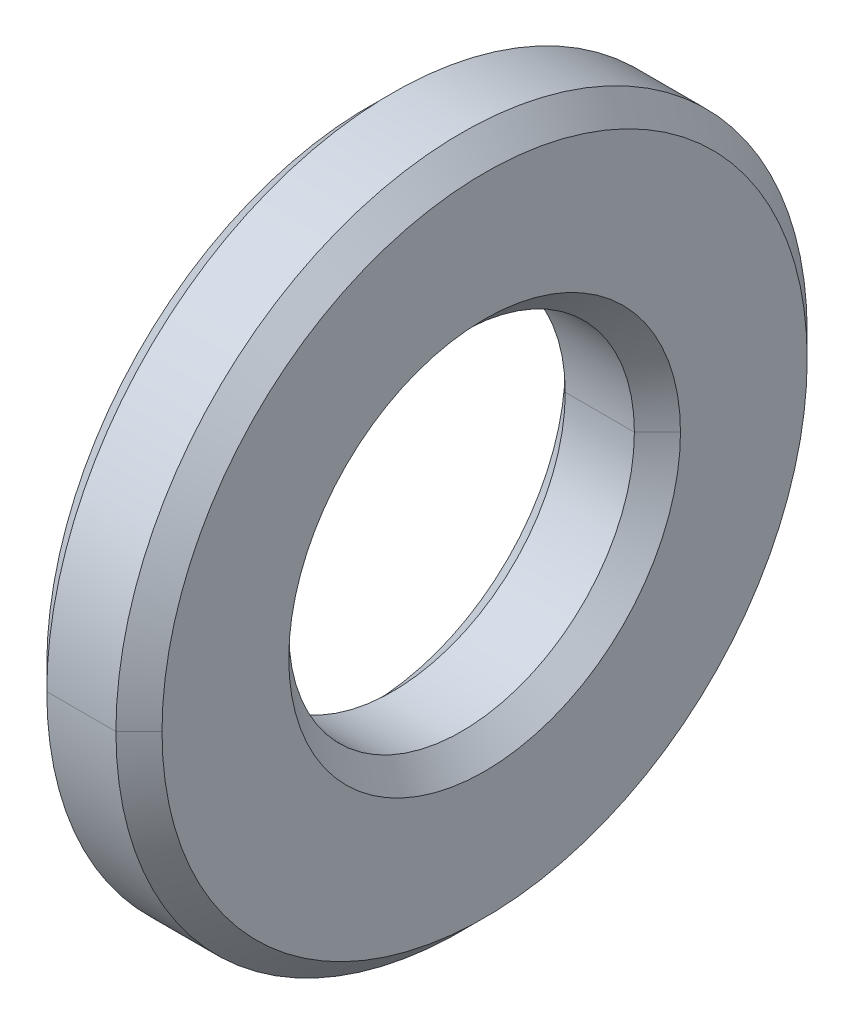
ISO-10303-21;
HEADER;
FILE_DESCRIPTION(('STEP AP214'),'2;1');
FILE_NAME('part.step','',(''),(''),'','','');
FILE_SCHEMA(('AUTOMOTIVE_DESIGN { 1 0 10303 214 1 1 1 1 }'));
ENDSEC;
DATA;
#1=APPLICATION_CONTEXT('core data for automotive mechanical design processes');
#2=APPLICATION_PROTOCOL_DEFINITION('international standard','automotive_design',2000,#1);
#3=PRODUCT_CONTEXT('',#1,'mechanical');
#4=PRODUCT('Part','Part','',(#3));
#5=PRODUCT_RELATED_PRODUCT_CATEGORY('part','',(#4));
#6=PRODUCT_DEFINITION_FORMATION('','',#4);
#7=PRODUCT_DEFINITION_CONTEXT('part definition',#1,'design');
#8=PRODUCT_DEFINITION('design','',#6,#7);
#9=PRODUCT_DEFINITION_SHAPE('','',#8);
#10=(LENGTH_UNIT() NAMED_UNIT(*) SI_UNIT(.MILLI.,.METRE.));
#11=(NAMED_UNIT(*) PLANE_ANGLE_UNIT() SI_UNIT($,.RADIAN.));
#12=(NAMED_UNIT(*) SI_UNIT($,.STERADIAN.) SOLID_ANGLE_UNIT());
#13=UNCERTAINTY_MEASURE_WITH_UNIT(LENGTH_MEASURE(1.E-05),#10,'distance_accuracy_value','');
#14=(GEOMETRIC_REPRESENTATION_CONTEXT(3) GLOBAL_UNCERTAINTY_ASSIGNED_CONTEXT((#13)) GLOBAL_UNIT_ASSIGNED_CONTEXT((#10,
#11,#12)) REPRESENTATION_CONTEXT('',''));
#15=CARTESIAN_POINT('',(0.,0.,0.));
#16=DIRECTION('',(0.,0.,1.));
#17=DIRECTION('',(1.,0.,0.));
#18=AXIS2_PLACEMENT_3D('',#15,#16,#17);
#19=CARTESIAN_POINT('',(1.,2.79999999999999,0.));
#20=DIRECTION('',(-1.,0.,0.));
#21=DIRECTION('',(0.,0.,1.00000000000002));
#22=AXIS2_PLACEMENT_3D('',#19,#20,#21);
#23=PLANE('',#22);
#24=CARTESIAN_POINT('',(1.,1.11022302462516E-13,-1.66533453693773E-13));
#25=DIRECTION('',(1.,0.,0.));
#26=DIRECTION('',(0.,0.,-1.00000000000002));
#27=AXIS2_PLACEMENT_3D('',#24,#25,#26);
#28=CIRCLE('',#27,1.7);
#29=CARTESIAN_POINT('',(0.999999999999994,0.,-1.70000000000009));
#30=VERTEX_POINT('',#29);
#31=CARTESIAN_POINT('',(0.999999999999508,0.,1.70000000000056));
#32=VERTEX_POINT('',#31);
#33=EDGE_CURVE('E11',#30,#32,#28,.T.);
#34=ORIENTED_EDGE('',*,*,#33,.F.);
#35=CARTESIAN_POINT('',(1.,1.11022302462516E-13,-1.66533453693773E-13));
#36=DIRECTION('',(1.,0.,0.));
#37=DIRECTION('',(0.,0.,-1.00000000000002));
#38=AXIS2_PLACEMENT_3D('',#35,#36,#37);
#39=CIRCLE('',#38,1.7);
#40=EDGE_CURVE('E25',#32,#30,#39,.T.);
#41=ORIENTED_EDGE('',*,*,#40,.F.);
#42=EDGE_LOOP('',(#34,#41));
#43=FACE_BOUND('',#42,.T.);
#44=CARTESIAN_POINT('',(1.,1.11022302462516E-13,-1.66533453693773E-13));
#45=DIRECTION('',(1.,0.,0.));
#46=DIRECTION('',(0.,0.,-1.00000000000002));
#47=AXIS2_PLACEMENT_3D('',#44,#45,#46);
#48=CIRCLE('',#47,2.8);
#49=CARTESIAN_POINT('',(0.999999999999945,0.,-2.80000000000019));
#50=VERTEX_POINT('',#49);
#51=CARTESIAN_POINT('',(0.99999999999955,0.,2.79999999999955));
#52=VERTEX_POINT('',#51);
#53=EDGE_CURVE('E393',#50,#52,#48,.T.);
#54=ORIENTED_EDGE('',*,*,#53,.T.);
#55=CARTESIAN_POINT('',(1.,1.11022302462516E-13,-1.66533453693773E-13));
#56=DIRECTION('',(1.,0.,0.));
#57=DIRECTION('',(0.,0.,-1.00000000000002));
#58=AXIS2_PLACEMENT_3D('',#55,#56,#57);
#59=CIRCLE('',#58,2.8);
#60=EDGE_CURVE('E388',#52,#50,#59,.T.);
#61=ORIENTED_EDGE('',*,*,#60,.T.);
#62=EDGE_LOOP('',(#54,#61));
#63=FACE_BOUND('',#62,.T.);
#64=ADVANCED_FACE('F16',(#43,#63),#23,.F.);
#65=CARTESIAN_POINT('',(0.799999999999995,1.11022302462516E-13,-1.66533453693773E-13));
#66=DIRECTION('',(-1.,0.,0.));
#67=DIRECTION('',(0.,1.00000000000002,0.));
#68=AXIS2_PLACEMENT_3D('',#65,#66,#67);
#69=CONICAL_SURFACE('',#68,3.,0.7853981634);
#70=CARTESIAN_POINT('',(0.799999999999995,1.11022302462516E-13,-1.66533453693773E-13));
#71=DIRECTION('',(1.,0.,0.));
#72=DIRECTION('',(0.,0.,-1.00000000000002));
#73=AXIS2_PLACEMENT_3D('',#70,#71,#72);
#74=CIRCLE('',#73,3.);
#75=CARTESIAN_POINT('',(0.800000000000051,0.,2.99999999999995));
#76=VERTEX_POINT('',#75);
#77=CARTESIAN_POINT('',(0.80000000000003,0.,-3.));
#78=VERTEX_POINT('',#77);
#79=EDGE_CURVE('E385',#76,#78,#74,.T.);
#80=ORIENTED_EDGE('',*,*,#79,.T.);
#81=CARTESIAN_POINT('',(0.999999999999485,1.11225791671262E-13,-2.7999999999997));
#82=DIRECTION('',(-0.707106781184737,0.,-0.707106781188358));
#83=VECTOR('',#82,1.);
#84=LINE('',#81,#83);
#85=EDGE_CURVE('E363',#50,#78,#84,.T.);
#86=ORIENTED_EDGE('',*,*,#85,.F.);
#87=ORIENTED_EDGE('',*,*,#60,.F.);
#88=CARTESIAN_POINT('',(0.999999999999485,1.10702239836183E-13,2.79999999999937));
#89=DIRECTION('',(-0.707106781184737,0.,0.707106781188358));
#90=VECTOR('',#89,1.);
#91=LINE('',#88,#90);
#92=EDGE_CURVE('E375',#52,#76,#91,.T.);
#93=ORIENTED_EDGE('',*,*,#92,.T.);
#94=EDGE_LOOP('',(#80,#86,#87,#93));
#95=FACE_BOUND('',#94,.T.);
#96=ADVANCED_FACE('F343',(#95),#69,.T.);
#97=CARTESIAN_POINT('',(0.799999999999995,1.11022302462516E-13,-1.66533453693773E-13));
#98=DIRECTION('',(-1.,0.,0.));
#99=DIRECTION('',(0.,-1.00000000000002,0.));
#100=AXIS2_PLACEMENT_3D('',#97,#98,#99);
#101=CONICAL_SURFACE('',#100,3.,0.7853981634);
#102=ORIENTED_EDGE('',*,*,#53,.F.);
#103=ORIENTED_EDGE('',*,*,#85,.T.);
#104=CARTESIAN_POINT('',(0.799999999999995,1.11022302462516E-13,-1.66533453693773E-13));
#105=DIRECTION('',(1.,0.,0.));
#106=DIRECTION('',(0.,0.,-1.00000000000002));
#107=AXIS2_PLACEMENT_3D('',#104,#105,#106);
#108=CIRCLE('',#107,3.);
#109=EDGE_CURVE('E415',#78,#76,#108,.T.);
#110=ORIENTED_EDGE('',*,*,#109,.T.);
#111=ORIENTED_EDGE('',*,*,#92,.F.);
#112=EDGE_LOOP('',(#102,#103,#110,#111));
#113=FACE_BOUND('',#112,.T.);
#114=ADVANCED_FACE('F335',(#113),#101,.T.);
#115=CARTESIAN_POINT('',(1.,1.11022302462516E-13,-1.66533453693773E-13));
#116=DIRECTION('',(-1.,0.,0.));
#117=DIRECTION('',(0.,-1.00000000000002,0.));
#118=AXIS2_PLACEMENT_3D('',#115,#116,#117);
#119=CYLINDRICAL_SURFACE('',#118,3.);
#120=ORIENTED_EDGE('',*,*,#109,.F.);
#121=CARTESIAN_POINT('',(0.800000000000001,1.11365226705015E-13,-3.00000000000021));
#122=DIRECTION('',(-1.,0.,0.));
#123=VECTOR('',#122,1.);
#124=LINE('',#121,#123);
#125=CARTESIAN_POINT('',(0.20000000000004,0.,-2.99999999999989));
#126=VERTEX_POINT('',#125);
#127=EDGE_CURVE('E298',#78,#126,#124,.T.);
#128=ORIENTED_EDGE('',*,*,#127,.T.);
#129=CARTESIAN_POINT('',(0.200000000000006,1.11022302462516E-13,0.));
#130=DIRECTION('',(1.,0.,0.));
#131=DIRECTION('',(0.,0.,-1.00000000000002));
#132=AXIS2_PLACEMENT_3D('',#129,#130,#131);
#133=CIRCLE('',#132,3.);
#134=CARTESIAN_POINT('',(0.19999999999995,0.,3.00000000000011));
#135=VERTEX_POINT('',#134);
#136=EDGE_CURVE('E316',#126,#135,#133,.T.);
#137=ORIENTED_EDGE('',*,*,#136,.T.);
#138=CARTESIAN_POINT('',(0.800000000000001,1.10804278310287E-13,2.99999999999988));
#139=DIRECTION('',(-1.,0.,0.));
#140=VECTOR('',#139,1.);
#141=LINE('',#138,#140);
#142=EDGE_CURVE('E301',#76,#135,#141,.T.);
#143=ORIENTED_EDGE('',*,*,#142,.F.);
#144=EDGE_LOOP('',(#120,#128,#137,#143));
#145=FACE_BOUND('',#144,.T.);
#146=ADVANCED_FACE('F281',(#145),#119,.T.);
#147=CARTESIAN_POINT('',(1.,1.11022302462516E-13,-1.66533453693773E-13));
#148=DIRECTION('',(-1.,0.,0.));
#149=DIRECTION('',(0.,1.00000000000002,0.));
#150=AXIS2_PLACEMENT_3D('',#147,#148,#149);
#151=CYLINDRICAL_SURFACE('',#150,3.);
#152=CARTESIAN_POINT('',(0.200000000000006,1.11022302462516E-13,0.));
#153=DIRECTION('',(1.,0.,0.));
#154=DIRECTION('',(0.,0.,-1.00000000000002));
#155=AXIS2_PLACEMENT_3D('',#152,#153,#154);
#156=CIRCLE('',#155,3.);
#157=EDGE_CURVE('E264',#135,#126,#156,.T.);
#158=ORIENTED_EDGE('',*,*,#157,.T.);
#159=ORIENTED_EDGE('',*,*,#127,.F.);
#160=ORIENTED_EDGE('',*,*,#79,.F.);
#161=ORIENTED_EDGE('',*,*,#142,.T.);
#162=EDGE_LOOP('',(#158,#159,#160,#161));
#163=FACE_BOUND('',#162,.T.);
#164=ADVANCED_FACE('F272',(#163),#151,.T.);
#165=CARTESIAN_POINT('',(0.,0.,0.));
#166=DIRECTION('',(1.,0.,0.));
#167=DIRECTION('',(0.,1.00000000000002,0.));
#168=AXIS2_PLACEMENT_3D('',#165,#166,#167);
#169=CONICAL_SURFACE('',#168,2.8,0.7853981634);
#170=CARTESIAN_POINT('',(0.,0.,0.));
#171=DIRECTION('',(1.,0.,0.));
#172=DIRECTION('',(0.,0.,-1.00000000000002));
#173=AXIS2_PLACEMENT_3D('',#170,#171,#172);
#174=CIRCLE('',#173,2.8);
#175=CARTESIAN_POINT('',(0.,0.,2.80000000000027));
#176=VERTEX_POINT('',#175);
#177=CARTESIAN_POINT('',(0.,0.,-2.80000000000002));
#178=VERTEX_POINT('',#177);
#179=EDGE_CURVE('E261',#176,#178,#174,.T.);
#180=ORIENTED_EDGE('',*,*,#179,.T.);
#181=CARTESIAN_POINT('',(0.,0.,-2.80000000000004));
#182=DIRECTION('',(0.707106781184737,0.,-0.707106781188358));
#183=VECTOR('',#182,1.);
#184=LINE('',#181,#183);
#185=EDGE_CURVE('E238',#178,#126,#184,.T.);
#186=ORIENTED_EDGE('',*,*,#185,.T.);
#187=ORIENTED_EDGE('',*,*,#157,.F.);
#188=CARTESIAN_POINT('',(0.,0.,2.80000000000004));
#189=DIRECTION('',(0.707106781184737,0.,0.707106781188358));
#190=VECTOR('',#189,1.);
#191=LINE('',#188,#190);
#192=EDGE_CURVE('E251',#176,#135,#191,.T.);
#193=ORIENTED_EDGE('',*,*,#192,.F.);
#194=EDGE_LOOP('',(#180,#186,#187,#193));
#195=FACE_BOUND('',#194,.T.);
#196=ADVANCED_FACE('F217',(#195),#169,.T.);
#197=CARTESIAN_POINT('',(0.,0.,0.));
#198=DIRECTION('',(1.,0.,0.));
#199=DIRECTION('',(0.,-1.00000000000002,0.));
#200=AXIS2_PLACEMENT_3D('',#197,#198,#199);
#201=CONICAL_SURFACE('',#200,2.8,0.7853981634);
#202=ORIENTED_EDGE('',*,*,#136,.F.);
#203=ORIENTED_EDGE('',*,*,#185,.F.);
#204=CARTESIAN_POINT('',(0.,0.,0.));
#205=DIRECTION('',(1.,0.,0.));
#206=DIRECTION('',(0.,0.,-1.00000000000002));
#207=AXIS2_PLACEMENT_3D('',#204,#205,#206);
#208=CIRCLE('',#207,2.8);
#209=EDGE_CURVE('E198',#178,#176,#208,.T.);
#210=ORIENTED_EDGE('',*,*,#209,.T.);
#211=ORIENTED_EDGE('',*,*,#192,.T.);
#212=EDGE_LOOP('',(#202,#203,#210,#211));
#213=FACE_BOUND('',#212,.T.);
#214=ADVANCED_FACE('F207',(#213),#201,.T.);
#215=CARTESIAN_POINT('',(0.,0.,0.));
#216=DIRECTION('',(1.,0.,0.));
#217=DIRECTION('',(0.,0.,-1.00000000000002));
#218=AXIS2_PLACEMENT_3D('',#215,#216,#217);
#219=PLANE('',#218);
#220=ORIENTED_EDGE('',*,*,#209,.F.);
#221=ORIENTED_EDGE('',*,*,#179,.F.);
#222=EDGE_LOOP('',(#220,#221));
#223=FACE_BOUND('',#222,.T.);
#224=CARTESIAN_POINT('',(0.,0.,0.));
#225=DIRECTION('',(1.,0.,0.));
#226=DIRECTION('',(0.,0.,-1.00000000000002));
#227=AXIS2_PLACEMENT_3D('',#224,#225,#226);
#228=CIRCLE('',#227,1.7);
#229=CARTESIAN_POINT('',(0.,-1.97758476261356E-13,-1.69999999999992));
#230=VERTEX_POINT('',#229);
#231=CARTESIAN_POINT('',(0.,-1.42247325030098E-13,1.70000000000009));
#232=VERTEX_POINT('',#231);
#233=EDGE_CURVE('E193',#230,#232,#228,.T.);
#234=ORIENTED_EDGE('',*,*,#233,.T.);
#235=CARTESIAN_POINT('',(0.,0.,0.));
#236=DIRECTION('',(1.,0.,0.));
#237=DIRECTION('',(0.,0.,-1.00000000000002));
#238=AXIS2_PLACEMENT_3D('',#235,#236,#237);
#239=CIRCLE('',#238,1.7);
#240=EDGE_CURVE('E190',#232,#230,#239,.T.);
#241=ORIENTED_EDGE('',*,*,#240,.T.);
#242=EDGE_LOOP('',(#234,#241));
#243=FACE_BOUND('',#242,.T.);
#244=ADVANCED_FACE('F216',(#223,#243),#219,.F.);
#245=CARTESIAN_POINT('',(0.,0.,0.));
#246=DIRECTION('',(-1.,0.,0.));
#247=DIRECTION('',(0.,1.00000000000002,0.));
#248=AXIS2_PLACEMENT_3D('',#245,#246,#247);
#249=CONICAL_SURFACE('',#248,1.7,0.7853981634);
#250=ORIENTED_EDGE('',*,*,#240,.F.);
#251=CARTESIAN_POINT('',(0.19999999999949,0.,1.49999999999951));
#252=DIRECTION('',(-0.707106781184738,0.,0.707106781188357));
#253=VECTOR('',#252,1.);
#254=LINE('',#251,#253);
#255=CARTESIAN_POINT('',(0.199999999999444,0.,1.49999999999972));
#256=VERTEX_POINT('',#255);
#257=EDGE_CURVE('E160',#256,#232,#254,.T.);
#258=ORIENTED_EDGE('',*,*,#257,.F.);
#259=CARTESIAN_POINT('',(0.200000000000006,1.11022302462516E-13,0.));
#260=DIRECTION('',(1.,0.,0.));
#261=DIRECTION('',(0.,0.,-1.00000000000002));
#262=AXIS2_PLACEMENT_3D('',#259,#260,#261);
#263=CIRCLE('',#262,1.5);
#264=CARTESIAN_POINT('',(0.20000000000004,0.,-1.49999999999997));
#265=VERTEX_POINT('',#264);
#266=EDGE_CURVE('E176',#256,#265,#263,.T.);
#267=ORIENTED_EDGE('',*,*,#266,.T.);
#268=CARTESIAN_POINT('',(0.19999999999949,0.,-1.49999999999951));
#269=DIRECTION('',(-0.707106781184738,0.,-0.707106781188357));
#270=VECTOR('',#269,1.);
#271=LINE('',#268,#270);
#272=EDGE_CURVE('E121',#265,#230,#271,.T.);
#273=ORIENTED_EDGE('',*,*,#272,.T.);
#274=EDGE_LOOP('',(#250,#258,#267,#273));
#275=FACE_BOUND('',#274,.T.);
#276=ADVANCED_FACE('F143',(#275),#249,.F.);
#277=CARTESIAN_POINT('',(0.,0.,0.));
#278=DIRECTION('',(-1.,0.,0.));
#279=DIRECTION('',(0.,-1.00000000000002,0.));
#280=AXIS2_PLACEMENT_3D('',#277,#278,#279);
#281=CONICAL_SURFACE('',#280,1.7,0.7853981634);
#282=CARTESIAN_POINT('',(0.200000000000006,1.11022302462516E-13,0.));
#283=DIRECTION('',(1.,0.,0.));
#284=DIRECTION('',(0.,0.,-1.00000000000002));
#285=AXIS2_PLACEMENT_3D('',#282,#283,#284);
#286=CIRCLE('',#285,1.5);
#287=EDGE_CURVE('E86',#265,#256,#286,.T.);
#288=ORIENTED_EDGE('',*,*,#287,.T.);
#289=ORIENTED_EDGE('',*,*,#257,.T.);
#290=ORIENTED_EDGE('',*,*,#233,.F.);
#291=ORIENTED_EDGE('',*,*,#272,.F.);
#292=EDGE_LOOP('',(#288,#289,#290,#291));
#293=FACE_BOUND('',#292,.T.);
#294=ADVANCED_FACE('F133',(#293),#281,.F.);
#295=CARTESIAN_POINT('',(1.,1.11022302462516E-13,-1.66533453693773E-13));
#296=DIRECTION('',(-1.,0.,0.));
#297=DIRECTION('',(0.,-1.00000000000002,0.));
#298=AXIS2_PLACEMENT_3D('',#295,#296,#297);
#299=CYLINDRICAL_SURFACE('',#298,1.5);
#300=CARTESIAN_POINT('',(0.799999999999995,1.11022302462516E-13,-1.66533453693773E-13));
#301=DIRECTION('',(1.,0.,0.));
#302=DIRECTION('',(0.,0.,-1.00000000000002));
#303=AXIS2_PLACEMENT_3D('',#300,#301,#302);
#304=CIRCLE('',#303,1.5);
#305=CARTESIAN_POINT('',(0.80000000000003,0.,-1.5000000000002));
#306=VERTEX_POINT('',#305);
#307=CARTESIAN_POINT('',(0.799999999999961,-1.11022302462516E-13,1.50000000000006));
#308=VERTEX_POINT('',#307);
#309=EDGE_CURVE('E83',#306,#308,#304,.T.);
#310=ORIENTED_EDGE('',*,*,#309,.T.);
#311=CARTESIAN_POINT('',(0.800000000000001,1.11034537361138E-13,1.49999999999986));
#312=DIRECTION('',(-1.,0.,0.));
#313=VECTOR('',#312,1.);
#314=LINE('',#311,#313);
#315=EDGE_CURVE('E91',#308,#256,#314,.T.);
#316=ORIENTED_EDGE('',*,*,#315,.T.);
#317=ORIENTED_EDGE('',*,*,#287,.F.);
#318=CARTESIAN_POINT('',(0.800000000000001,1.10947617518758E-13,-1.50000000000019));
#319=DIRECTION('',(-1.,0.,0.));
#320=VECTOR('',#319,1.);
#321=LINE('',#318,#320);
#322=EDGE_CURVE('E77',#306,#265,#321,.T.);
#323=ORIENTED_EDGE('',*,*,#322,.F.);
#324=EDGE_LOOP('',(#310,#316,#317,#323));
#325=FACE_BOUND('',#324,.T.);
#326=ADVANCED_FACE('F80',(#325),#299,.F.);
#327=CARTESIAN_POINT('',(1.,1.11022302462516E-13,-1.66533453693773E-13));
#328=DIRECTION('',(-1.,0.,0.));
#329=DIRECTION('',(0.,1.00000000000002,0.));
#330=AXIS2_PLACEMENT_3D('',#327,#328,#329);
#331=CYLINDRICAL_SURFACE('',#330,1.5);
#332=ORIENTED_EDGE('',*,*,#266,.F.);
#333=ORIENTED_EDGE('',*,*,#315,.F.);
#334=CARTESIAN_POINT('',(0.799999999999995,1.11022302462516E-13,-1.66533453693773E-13));
#335=DIRECTION('',(1.,0.,0.));
#336=DIRECTION('',(0.,0.,-1.00000000000002));
#337=AXIS2_PLACEMENT_3D('',#334,#335,#336);
#338=CIRCLE('',#337,1.5);
#339=EDGE_CURVE('E92',#308,#306,#338,.T.);
#340=ORIENTED_EDGE('',*,*,#339,.T.);
#341=ORIENTED_EDGE('',*,*,#322,.T.);
#342=EDGE_LOOP('',(#332,#333,#340,#341));
#343=FACE_BOUND('',#342,.T.);
#344=ADVANCED_FACE('F97',(#343),#331,.F.);
#345=CARTESIAN_POINT('',(0.799999999999995,1.11022302462516E-13,-1.66533453693773E-13));
#346=DIRECTION('',(1.,0.,0.));
#347=DIRECTION('',(0.,1.00000000000002,0.));
#348=AXIS2_PLACEMENT_3D('',#345,#346,#347);
#349=CONICAL_SURFACE('',#348,1.5,0.7853981634);
#350=ORIENTED_EDGE('',*,*,#339,.F.);
#351=CARTESIAN_POINT('',(0.799999999999995,1.11280684426145E-13,1.49999999999986));
#352=DIRECTION('',(0.707106781184738,0.,0.707106781188357));
#353=VECTOR('',#352,1.);
#354=LINE('',#351,#353);
#355=EDGE_CURVE('E102',#308,#32,#354,.T.);
#356=ORIENTED_EDGE('',*,*,#355,.T.);
#357=ORIENTED_EDGE('',*,*,#40,.T.);
#358=CARTESIAN_POINT('',(0.799999999999995,1.10826370544021E-13,-1.50000000000019));
#359=DIRECTION('',(0.707106781184738,0.,-0.707106781188357));
#360=VECTOR('',#359,1.);
#361=LINE('',#358,#360);
#362=EDGE_CURVE('E105',#306,#30,#361,.T.);
#363=ORIENTED_EDGE('',*,*,#362,.F.);
#364=EDGE_LOOP('',(#350,#356,#357,#363));
#365=FACE_BOUND('',#364,.T.);
#366=ADVANCED_FACE('F107',(#365),#349,.F.);
#367=CARTESIAN_POINT('',(0.799999999999995,1.11022302462516E-13,-1.66533453693773E-13));
#368=DIRECTION('',(1.,0.,0.));
#369=DIRECTION('',(0.,-1.00000000000002,0.));
#370=AXIS2_PLACEMENT_3D('',#367,#368,#369);
#371=CONICAL_SURFACE('',#370,1.5,0.7853981634);
#372=ORIENTED_EDGE('',*,*,#33,.T.);
#373=ORIENTED_EDGE('',*,*,#355,.F.);
#374=ORIENTED_EDGE('',*,*,#309,.F.);
#375=ORIENTED_EDGE('',*,*,#362,.T.);
#376=EDGE_LOOP('',(#372,#373,#374,#375));
#377=FACE_BOUND('',#376,.T.);
#378=ADVANCED_FACE('F113',(#377),#371,.F.);
#379=CLOSED_SHELL('',(#64,#96,#114,#146,#164,#196,#214,#244,#276,#294,#326,#344,#366,#378));
#380=MANIFOLD_SOLID_BREP('B1',#379);
#381=ADVANCED_BREP_SHAPE_REPRESENTATION('',(#18,#380),#14);
#382=SHAPE_DEFINITION_REPRESENTATION(#9,#381);
ENDSEC;
END-ISO-10303-21;
